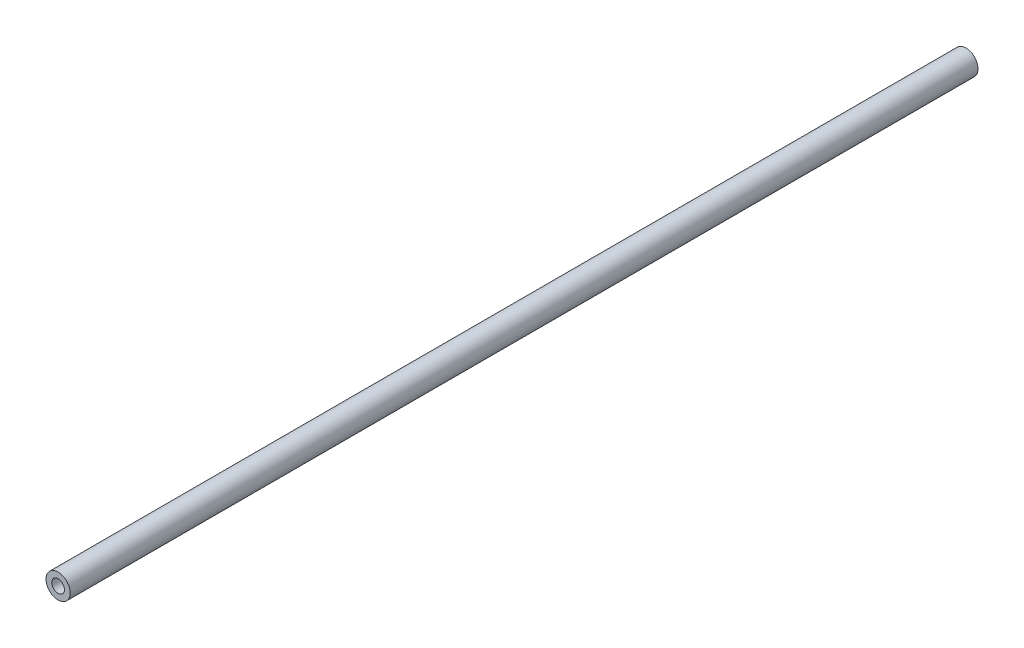
ISO-10303-21;
HEADER;
FILE_DESCRIPTION(('STEP AP214'),'2;1');
FILE_NAME('part.step','',(''),(''),'','','');
FILE_SCHEMA(('AUTOMOTIVE_DESIGN { 1 0 10303 214 1 1 1 1 }'));
ENDSEC;
DATA;
#1=APPLICATION_CONTEXT('core data for automotive mechanical design processes');
#2=APPLICATION_PROTOCOL_DEFINITION('international standard','automotive_design',2000,#1);
#3=PRODUCT_CONTEXT('',#1,'mechanical');
#4=PRODUCT('Part','Part','',(#3));
#5=PRODUCT_RELATED_PRODUCT_CATEGORY('part','',(#4));
#6=PRODUCT_DEFINITION_FORMATION('','',#4);
#7=PRODUCT_DEFINITION_CONTEXT('part definition',#1,'design');
#8=PRODUCT_DEFINITION('design','',#6,#7);
#9=PRODUCT_DEFINITION_SHAPE('','',#8);
#10=(LENGTH_UNIT() NAMED_UNIT(*) SI_UNIT(.MILLI.,.METRE.));
#11=(NAMED_UNIT(*) PLANE_ANGLE_UNIT() SI_UNIT($,.RADIAN.));
#12=(NAMED_UNIT(*) SI_UNIT($,.STERADIAN.) SOLID_ANGLE_UNIT());
#13=UNCERTAINTY_MEASURE_WITH_UNIT(LENGTH_MEASURE(1.E-05),#10,'distance_accuracy_value','');
#14=(GEOMETRIC_REPRESENTATION_CONTEXT(3) GLOBAL_UNCERTAINTY_ASSIGNED_CONTEXT((#13)) GLOBAL_UNIT_ASSIGNED_CONTEXT((#10,
#11,#12)) REPRESENTATION_CONTEXT('',''));
#15=CARTESIAN_POINT('',(0.,0.,0.));
#16=DIRECTION('',(0.,0.,1.));
#17=DIRECTION('',(1.,0.,0.));
#18=AXIS2_PLACEMENT_3D('',#15,#16,#17);
#19=CARTESIAN_POINT('',(0.,0.,-300.));
#20=DIRECTION('',(0.,0.,1.));
#21=DIRECTION('',(1.,0.,0.));
#22=AXIS2_PLACEMENT_3D('',#19,#20,#21);
#23=CYLINDRICAL_SURFACE('',#22,4.);
#24=CARTESIAN_POINT('',(0.,0.,-300.));
#25=DIRECTION('',(0.,0.,1.));
#26=DIRECTION('',(1.,0.,0.));
#27=AXIS2_PLACEMENT_3D('',#24,#25,#26);
#28=CIRCLE('',#27,4.);
#29=CARTESIAN_POINT('',(4.,0.,-300.));
#30=VERTEX_POINT('',#29);
#31=EDGE_CURVE('E11',#30,#30,#28,.T.);
#32=ORIENTED_EDGE('',*,*,#31,.T.);
#33=EDGE_LOOP('',(#32));
#34=FACE_BOUND('',#33,.T.);
#35=CARTESIAN_POINT('',(0.,0.,0.));
#36=DIRECTION('',(0.,0.,1.));
#37=DIRECTION('',(1.,0.,0.));
#38=AXIS2_PLACEMENT_3D('',#35,#36,#37);
#39=CIRCLE('',#38,4.);
#40=CARTESIAN_POINT('',(4.,0.,0.));
#41=VERTEX_POINT('',#40);
#42=EDGE_CURVE('E56',#41,#41,#39,.T.);
#43=ORIENTED_EDGE('',*,*,#42,.F.);
#44=EDGE_LOOP('',(#43));
#45=FACE_BOUND('',#44,.T.);
#46=ADVANCED_FACE('F53',(#34,#45),#23,.T.);
#47=CARTESIAN_POINT('',(0.,0.,-300.));
#48=DIRECTION('',(0.,0.,1.));
#49=DIRECTION('',(1.,0.,0.));
#50=AXIS2_PLACEMENT_3D('',#47,#48,#49);
#51=PLANE('',#50);
#52=ORIENTED_EDGE('',*,*,#31,.F.);
#53=EDGE_LOOP('',(#52));
#54=FACE_BOUND('',#53,.T.);
#55=ADVANCED_FACE('F86',(#54),#51,.F.);
#56=CARTESIAN_POINT('',(0.,0.,0.));
#57=DIRECTION('',(0.,0.,1.));
#58=DIRECTION('',(1.,0.,0.));
#59=AXIS2_PLACEMENT_3D('',#56,#57,#58);
#60=PLANE('',#59);
#61=CARTESIAN_POINT('',(0.,0.,0.));
#62=DIRECTION('',(0.,0.,1.));
#63=DIRECTION('',(1.,0.,0.));
#64=AXIS2_PLACEMENT_3D('',#61,#62,#63);
#65=CIRCLE('',#64,2.09999999999999);
#66=CARTESIAN_POINT('',(2.09999999999999,0.,0.));
#67=VERTEX_POINT('',#66);
#68=EDGE_CURVE('E74',#67,#67,#65,.T.);
#69=ORIENTED_EDGE('',*,*,#68,.F.);
#70=EDGE_LOOP('',(#69));
#71=FACE_BOUND('',#70,.T.);
#72=ORIENTED_EDGE('',*,*,#42,.T.);
#73=EDGE_LOOP('',(#72));
#74=FACE_BOUND('',#73,.T.);
#75=ADVANCED_FACE('F67',(#71,#74),#60,.T.);
#76=CARTESIAN_POINT('',(0.,0.,-10.));
#77=DIRECTION('',(0.,0.,1.));
#78=DIRECTION('',(1.,0.,0.));
#79=AXIS2_PLACEMENT_3D('',#76,#77,#78);
#80=CONICAL_SURFACE('',#79,2.1,1.02974425867665);
#81=CARTESIAN_POINT('',(0.,0.,-11.2618072999579));
#82=VERTEX_POINT('',#81);
#83=VERTEX_LOOP('',#82);
#84=FACE_BOUND('',#83,.T.);
#85=CARTESIAN_POINT('',(0.,0.,-10.));
#86=DIRECTION('',(0.,0.,1.));
#87=DIRECTION('',(1.,0.,0.));
#88=AXIS2_PLACEMENT_3D('',#85,#86,#87);
#89=CIRCLE('',#88,2.1);
#90=CARTESIAN_POINT('',(2.1,0.,-10.));
#91=VERTEX_POINT('',#90);
#92=EDGE_CURVE('E71',#91,#91,#89,.T.);
#93=ORIENTED_EDGE('',*,*,#92,.T.);
#94=EDGE_LOOP('',(#93));
#95=FACE_BOUND('',#94,.T.);
#96=ADVANCED_FACE('F63',(#84,#95),#80,.F.);
#97=CARTESIAN_POINT('',(0.,0.,0.));
#98=DIRECTION('',(0.,0.,1.));
#99=DIRECTION('',(1.,0.,0.));
#100=AXIS2_PLACEMENT_3D('',#97,#98,#99);
#101=CYLINDRICAL_SURFACE('',#100,2.09999999999999);
#102=ORIENTED_EDGE('',*,*,#92,.F.);
#103=EDGE_LOOP('',(#102));
#104=FACE_BOUND('',#103,.T.);
#105=ORIENTED_EDGE('',*,*,#68,.T.);
#106=EDGE_LOOP('',(#105));
#107=FACE_BOUND('',#106,.T.);
#108=ADVANCED_FACE('F66',(#104,#107),#101,.F.);
#109=CLOSED_SHELL('',(#46,#55,#75,#96,#108));
#110=MANIFOLD_SOLID_BREP('B2',#109);
#111=ADVANCED_BREP_SHAPE_REPRESENTATION('',(#18,#110),#14);
#112=SHAPE_DEFINITION_REPRESENTATION(#9,#111);
ENDSEC;
END-ISO-10303-21;
